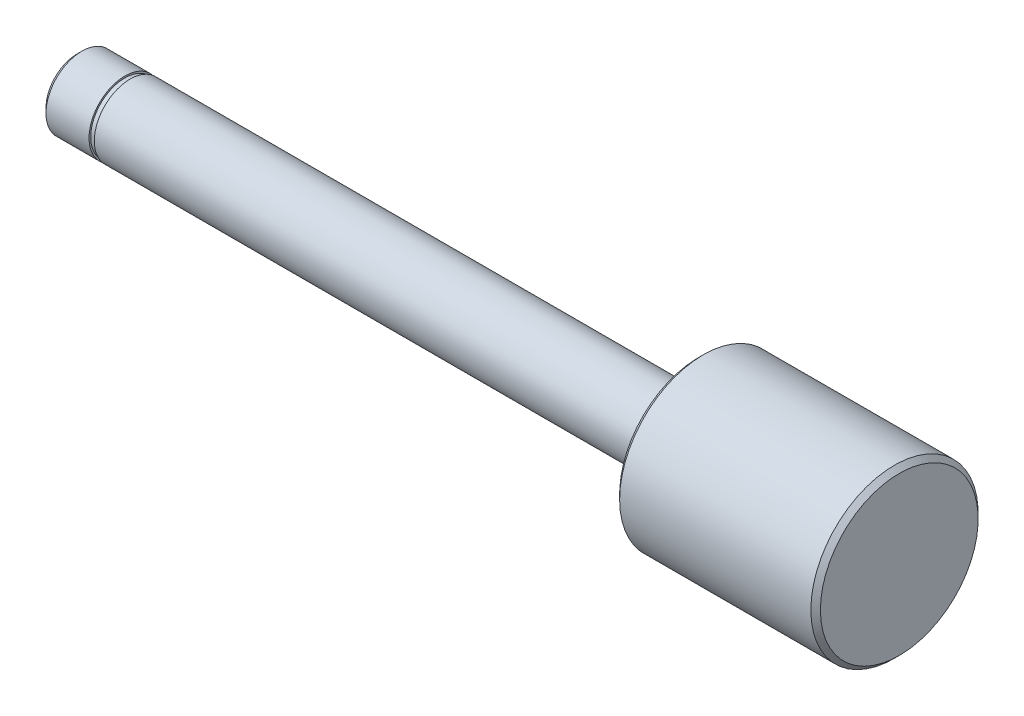
ISO-10303-21;
HEADER;
FILE_DESCRIPTION(('STEP AP214'),'2;1');
FILE_NAME('part.step','',(''),(''),'','','');
FILE_SCHEMA(('AUTOMOTIVE_DESIGN { 1 0 10303 214 1 1 1 1 }'));
ENDSEC;
DATA;
#1=APPLICATION_CONTEXT('core data for automotive mechanical design processes');
#2=APPLICATION_PROTOCOL_DEFINITION('international standard','automotive_design',2000,#1);
#3=PRODUCT_CONTEXT('',#1,'mechanical');
#4=PRODUCT('Part','Part','',(#3));
#5=PRODUCT_RELATED_PRODUCT_CATEGORY('part','',(#4));
#6=PRODUCT_DEFINITION_FORMATION('','',#4);
#7=PRODUCT_DEFINITION_CONTEXT('part definition',#1,'design');
#8=PRODUCT_DEFINITION('design','',#6,#7);
#9=PRODUCT_DEFINITION_SHAPE('','',#8);
#10=(LENGTH_UNIT() NAMED_UNIT(*) SI_UNIT(.MILLI.,.METRE.));
#11=(NAMED_UNIT(*) PLANE_ANGLE_UNIT() SI_UNIT($,.RADIAN.));
#12=(NAMED_UNIT(*) SI_UNIT($,.STERADIAN.) SOLID_ANGLE_UNIT());
#13=UNCERTAINTY_MEASURE_WITH_UNIT(LENGTH_MEASURE(1.E-05),#10,'distance_accuracy_value','');
#14=(GEOMETRIC_REPRESENTATION_CONTEXT(3) GLOBAL_UNCERTAINTY_ASSIGNED_CONTEXT((#13)) GLOBAL_UNIT_ASSIGNED_CONTEXT((#10,
#11,#12)) REPRESENTATION_CONTEXT('',''));
#15=CARTESIAN_POINT('',(0.,0.,0.));
#16=DIRECTION('',(0.,0.,1.));
#17=DIRECTION('',(1.,0.,0.));
#18=AXIS2_PLACEMENT_3D('',#15,#16,#17);
#19=CARTESIAN_POINT('',(-86.,0.,0.));
#20=DIRECTION('',(-1.,0.,0.));
#21=DIRECTION('',(0.,0.,1.));
#22=AXIS2_PLACEMENT_3D('',#19,#20,#21);
#23=CYLINDRICAL_SURFACE('',#22,7.5);
#24=CARTESIAN_POINT('',(-74.9,0.,0.));
#25=DIRECTION('',(1.,0.,0.));
#26=DIRECTION('',(0.,0.,-1.));
#27=AXIS2_PLACEMENT_3D('',#24,#25,#26);
#28=CIRCLE('',#27,7.5);
#29=CARTESIAN_POINT('',(-74.9,0.,-7.5));
#30=VERTEX_POINT('',#29);
#31=EDGE_CURVE('E71',#30,#30,#28,.T.);
#32=ORIENTED_EDGE('',*,*,#31,.T.);
#33=EDGE_LOOP('',(#32));
#34=FACE_BOUND('',#33,.T.);
#35=CARTESIAN_POINT('',(44.,0.,0.));
#36=DIRECTION('',(-1.,0.,0.));
#37=DIRECTION('',(0.,0.,1.));
#38=AXIS2_PLACEMENT_3D('',#35,#36,#37);
#39=CIRCLE('',#38,7.5);
#40=CARTESIAN_POINT('',(44.,0.,7.5));
#41=VERTEX_POINT('',#40);
#42=EDGE_CURVE('E81',#41,#41,#39,.T.);
#43=ORIENTED_EDGE('',*,*,#42,.T.);
#44=EDGE_LOOP('',(#43));
#45=FACE_BOUND('',#44,.T.);
#46=ADVANCED_FACE('F51',(#34,#45),#23,.T.);
#47=CARTESIAN_POINT('',(44.,7.5,0.));
#48=DIRECTION('',(1.,0.,0.));
#49=DIRECTION('',(0.,0.,-1.));
#50=AXIS2_PLACEMENT_3D('',#47,#48,#49);
#51=PLANE('',#50);
#52=CARTESIAN_POINT('',(44.,0.,0.));
#53=DIRECTION('',(1.,0.,0.));
#54=DIRECTION('',(0.,0.,-1.));
#55=AXIS2_PLACEMENT_3D('',#52,#53,#54);
#56=CIRCLE('',#55,16.5);
#57=CARTESIAN_POINT('',(44.,0.,-16.5));
#58=VERTEX_POINT('',#57);
#59=EDGE_CURVE('E68',#58,#58,#56,.F.);
#60=ORIENTED_EDGE('',*,*,#59,.T.);
#61=EDGE_LOOP('',(#60));
#62=FACE_BOUND('',#61,.T.);
#63=ORIENTED_EDGE('',*,*,#42,.F.);
#64=EDGE_LOOP('',(#63));
#65=FACE_BOUND('',#64,.T.);
#66=ADVANCED_FACE('F111',(#62,#65),#51,.F.);
#67=CARTESIAN_POINT('',(-86.,0.,0.));
#68=DIRECTION('',(-1.,0.,0.));
#69=DIRECTION('',(0.,0.,1.));
#70=AXIS2_PLACEMENT_3D('',#67,#68,#69);
#71=CYLINDRICAL_SURFACE('',#70,17.5);
#72=CARTESIAN_POINT('',(85.,0.,0.));
#73=DIRECTION('',(-1.,0.,0.));
#74=DIRECTION('',(0.,0.,1.));
#75=AXIS2_PLACEMENT_3D('',#72,#73,#74);
#76=CIRCLE('',#75,17.5);
#77=CARTESIAN_POINT('',(85.,0.,17.5));
#78=VERTEX_POINT('',#77);
#79=EDGE_CURVE('E99',#78,#78,#76,.T.);
#80=ORIENTED_EDGE('',*,*,#79,.T.);
#81=EDGE_LOOP('',(#80));
#82=FACE_BOUND('',#81,.T.);
#83=CARTESIAN_POINT('',(45.,0.,0.));
#84=DIRECTION('',(1.,0.,0.));
#85=DIRECTION('',(0.,0.,-1.));
#86=AXIS2_PLACEMENT_3D('',#83,#84,#85);
#87=CIRCLE('',#86,17.5);
#88=CARTESIAN_POINT('',(45.,0.,-17.5));
#89=VERTEX_POINT('',#88);
#90=EDGE_CURVE('E95',#89,#89,#87,.T.);
#91=ORIENTED_EDGE('',*,*,#90,.T.);
#92=EDGE_LOOP('',(#91));
#93=FACE_BOUND('',#92,.T.);
#94=ADVANCED_FACE('F137',(#82,#93),#71,.T.);
#95=CARTESIAN_POINT('',(86.,17.5,0.));
#96=DIRECTION('',(-1.,0.,0.));
#97=DIRECTION('',(0.,0.,1.));
#98=AXIS2_PLACEMENT_3D('',#95,#96,#97);
#99=PLANE('',#98);
#100=CARTESIAN_POINT('',(86.,0.,0.));
#101=DIRECTION('',(-1.,0.,0.));
#102=DIRECTION('',(0.,0.,1.));
#103=AXIS2_PLACEMENT_3D('',#100,#101,#102);
#104=CIRCLE('',#103,16.5);
#105=CARTESIAN_POINT('',(86.,0.,16.5));
#106=VERTEX_POINT('',#105);
#107=EDGE_CURVE('E103',#106,#106,#104,.F.);
#108=ORIENTED_EDGE('',*,*,#107,.T.);
#109=EDGE_LOOP('',(#108));
#110=FACE_BOUND('',#109,.T.);
#111=ADVANCED_FACE('F126',(#110),#99,.F.);
#112=CARTESIAN_POINT('',(85.,0.,0.));
#113=DIRECTION('',(-1.,0.,0.));
#114=DIRECTION('',(0.,0.,1.));
#115=AXIS2_PLACEMENT_3D('',#112,#113,#114);
#116=CONICAL_SURFACE('',#115,17.5,0.785398163397462);
#117=ORIENTED_EDGE('',*,*,#107,.F.);
#118=EDGE_LOOP('',(#117));
#119=FACE_BOUND('',#118,.T.);
#120=ORIENTED_EDGE('',*,*,#79,.F.);
#121=EDGE_LOOP('',(#120));
#122=FACE_BOUND('',#121,.T.);
#123=ADVANCED_FACE('F117',(#119,#122),#116,.T.);
#124=CARTESIAN_POINT('',(44.,0.,0.));
#125=DIRECTION('',(1.,0.,0.));
#126=DIRECTION('',(0.,0.,-1.));
#127=AXIS2_PLACEMENT_3D('',#124,#125,#126);
#128=CONICAL_SURFACE('',#127,16.5,0.785398163397441);
#129=ORIENTED_EDGE('',*,*,#90,.F.);
#130=EDGE_LOOP('',(#129));
#131=FACE_BOUND('',#130,.T.);
#132=ORIENTED_EDGE('',*,*,#59,.F.);
#133=EDGE_LOOP('',(#132));
#134=FACE_BOUND('',#133,.T.);
#135=ADVANCED_FACE('F114',(#131,#134),#128,.T.);
#136=CARTESIAN_POINT('',(-76.,15.6540885040885,0.));
#137=DIRECTION('',(-1.,0.,0.));
#138=DIRECTION('',(0.,0.,1.));
#139=AXIS2_PLACEMENT_3D('',#136,#137,#138);
#140=PLANE('',#139);
#141=CARTESIAN_POINT('',(-76.,0.,0.));
#142=DIRECTION('',(1.,0.,0.));
#143=DIRECTION('',(0.,0.,-1.));
#144=AXIS2_PLACEMENT_3D('',#141,#142,#143);
#145=CIRCLE('',#144,7.14999999999999);
#146=CARTESIAN_POINT('',(-76.,0.,-7.14999999999999));
#147=VERTEX_POINT('',#146);
#148=EDGE_CURVE('E74',#147,#147,#145,.T.);
#149=ORIENTED_EDGE('',*,*,#148,.F.);
#150=EDGE_LOOP('',(#149));
#151=FACE_BOUND('',#150,.T.);
#152=CARTESIAN_POINT('',(-76.,0.,0.));
#153=DIRECTION('',(-1.,0.,0.));
#154=DIRECTION('',(0.,0.,1.));
#155=AXIS2_PLACEMENT_3D('',#152,#153,#154);
#156=CIRCLE('',#155,7.5);
#157=CARTESIAN_POINT('',(-76.,0.,7.5));
#158=VERTEX_POINT('',#157);
#159=EDGE_CURVE('E56',#158,#158,#156,.T.);
#160=ORIENTED_EDGE('',*,*,#159,.F.);
#161=EDGE_LOOP('',(#160));
#162=FACE_BOUND('',#161,.T.);
#163=ADVANCED_FACE('F116',(#151,#162),#140,.F.);
#164=CARTESIAN_POINT('',(-74.9,15.6540885040885,0.));
#165=DIRECTION('',(1.,0.,0.));
#166=DIRECTION('',(0.,0.,-1.));
#167=AXIS2_PLACEMENT_3D('',#164,#165,#166);
#168=PLANE('',#167);
#169=CARTESIAN_POINT('',(-74.9,0.,0.));
#170=DIRECTION('',(1.,0.,0.));
#171=DIRECTION('',(0.,0.,-1.));
#172=AXIS2_PLACEMENT_3D('',#169,#170,#171);
#173=CIRCLE('',#172,7.14999999999999);
#174=CARTESIAN_POINT('',(-74.9,0.,-7.14999999999999));
#175=VERTEX_POINT('',#174);
#176=EDGE_CURVE('E83',#175,#175,#173,.T.);
#177=ORIENTED_EDGE('',*,*,#176,.T.);
#178=EDGE_LOOP('',(#177));
#179=FACE_BOUND('',#178,.T.);
#180=ORIENTED_EDGE('',*,*,#31,.F.);
#181=EDGE_LOOP('',(#180));
#182=FACE_BOUND('',#181,.T.);
#183=ADVANCED_FACE('F123',(#179,#182),#168,.F.);
#184=CARTESIAN_POINT('',(0.,0.,0.));
#185=DIRECTION('',(1.,0.,0.));
#186=DIRECTION('',(0.,0.,-1.));
#187=AXIS2_PLACEMENT_3D('',#184,#185,#186);
#188=CYLINDRICAL_SURFACE('',#187,7.14999999999999);
#189=ORIENTED_EDGE('',*,*,#176,.F.);
#190=EDGE_LOOP('',(#189));
#191=FACE_BOUND('',#190,.T.);
#192=ORIENTED_EDGE('',*,*,#148,.T.);
#193=EDGE_LOOP('',(#192));
#194=FACE_BOUND('',#193,.T.);
#195=ADVANCED_FACE('F153',(#191,#194),#188,.T.);
#196=CARTESIAN_POINT('',(-86.,0.,0.));
#197=DIRECTION('',(1.,0.,0.));
#198=DIRECTION('',(0.,0.,-1.));
#199=AXIS2_PLACEMENT_3D('',#196,#197,#198);
#200=PLANE('',#199);
#201=CARTESIAN_POINT('',(-86.,0.,0.));
#202=DIRECTION('',(1.,0.,0.));
#203=DIRECTION('',(0.,0.,-1.));
#204=AXIS2_PLACEMENT_3D('',#201,#202,#203);
#205=CIRCLE('',#204,6.50000000000003);
#206=CARTESIAN_POINT('',(-86.,0.,-6.50000000000003));
#207=VERTEX_POINT('',#206);
#208=EDGE_CURVE('E61',#207,#207,#205,.F.);
#209=ORIENTED_EDGE('',*,*,#208,.T.);
#210=EDGE_LOOP('',(#209));
#211=FACE_BOUND('',#210,.T.);
#212=ADVANCED_FACE('F146',(#211),#200,.F.);
#213=CARTESIAN_POINT('',(-86.,0.,0.));
#214=DIRECTION('',(1.,0.,0.));
#215=DIRECTION('',(0.,0.,-1.));
#216=AXIS2_PLACEMENT_3D('',#213,#214,#215);
#217=CONICAL_SURFACE('',#216,6.50000000000003,0.785398163397451);
#218=CARTESIAN_POINT('',(-85.,0.,0.));
#219=DIRECTION('',(1.,0.,0.));
#220=DIRECTION('',(0.,0.,-1.));
#221=AXIS2_PLACEMENT_3D('',#218,#219,#220);
#222=CIRCLE('',#221,7.5);
#223=CARTESIAN_POINT('',(-85.,0.,-7.5));
#224=VERTEX_POINT('',#223);
#225=EDGE_CURVE('E12',#224,#224,#222,.T.);
#226=ORIENTED_EDGE('',*,*,#225,.F.);
#227=EDGE_LOOP('',(#226));
#228=FACE_BOUND('',#227,.T.);
#229=ORIENTED_EDGE('',*,*,#208,.F.);
#230=EDGE_LOOP('',(#229));
#231=FACE_BOUND('',#230,.T.);
#232=ADVANCED_FACE('F54',(#228,#231),#217,.T.);
#233=ORIENTED_EDGE('',*,*,#159,.T.);
#234=EDGE_LOOP('',(#233));
#235=FACE_BOUND('',#234,.T.);
#236=ORIENTED_EDGE('',*,*,#225,.T.);
#237=EDGE_LOOP('',(#236));
#238=FACE_BOUND('',#237,.T.);
#239=ADVANCED_FACE('F133',(#235,#238),#23,.T.);
#240=CLOSED_SHELL('',(#46,#66,#94,#111,#123,#135,#163,#183,#195,#212,#232,#239));
#241=MANIFOLD_SOLID_BREP('B2',#240);
#242=ADVANCED_BREP_SHAPE_REPRESENTATION('',(#18,#241),#14);
#243=SHAPE_DEFINITION_REPRESENTATION(#9,#242);
ENDSEC;
END-ISO-10303-21;
